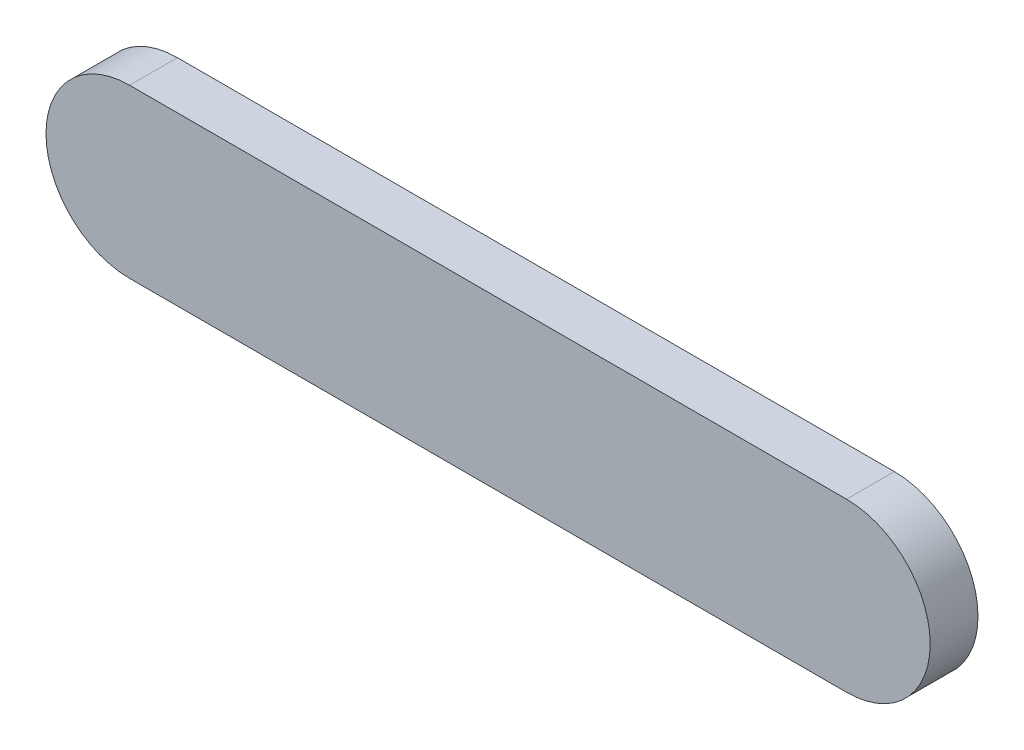
ISO-10303-21;
HEADER;
FILE_DESCRIPTION(('STEP AP214'),'2;1');
FILE_NAME('part.step','',(''),(''),'','','');
FILE_SCHEMA(('AUTOMOTIVE_DESIGN { 1 0 10303 214 1 1 1 1 }'));
ENDSEC;
DATA;
#1=APPLICATION_CONTEXT('core data for automotive mechanical design processes');
#2=APPLICATION_PROTOCOL_DEFINITION('international standard','automotive_design',2000,#1);
#3=PRODUCT_CONTEXT('',#1,'mechanical');
#4=PRODUCT('Part','Part','',(#3));
#5=PRODUCT_RELATED_PRODUCT_CATEGORY('part','',(#4));
#6=PRODUCT_DEFINITION_FORMATION('','',#4);
#7=PRODUCT_DEFINITION_CONTEXT('part definition',#1,'design');
#8=PRODUCT_DEFINITION('design','',#6,#7);
#9=PRODUCT_DEFINITION_SHAPE('','',#8);
#10=(LENGTH_UNIT() NAMED_UNIT(*) SI_UNIT(.MILLI.,.METRE.));
#11=(NAMED_UNIT(*) PLANE_ANGLE_UNIT() SI_UNIT($,.RADIAN.));
#12=(NAMED_UNIT(*) SI_UNIT($,.STERADIAN.) SOLID_ANGLE_UNIT());
#13=UNCERTAINTY_MEASURE_WITH_UNIT(LENGTH_MEASURE(1.E-05),#10,'distance_accuracy_value','');
#14=(GEOMETRIC_REPRESENTATION_CONTEXT(3) GLOBAL_UNCERTAINTY_ASSIGNED_CONTEXT((#13)) GLOBAL_UNIT_ASSIGNED_CONTEXT((#10,
#11,#12)) REPRESENTATION_CONTEXT('',''));
#15=CARTESIAN_POINT('',(0.,0.,0.));
#16=DIRECTION('',(0.,0.,1.));
#17=DIRECTION('',(1.,0.,0.));
#18=AXIS2_PLACEMENT_3D('',#15,#16,#17);
#19=CARTESIAN_POINT('',(-90.,0.,12.));
#20=DIRECTION('',(0.,0.,-1.));
#21=DIRECTION('',(-1.,0.,0.));
#22=AXIS2_PLACEMENT_3D('',#19,#20,#21);
#23=CYLINDRICAL_SURFACE('',#22,21.);
#24=CARTESIAN_POINT('',(-90.,0.,0.));
#25=DIRECTION('',(0.,0.,1.));
#26=DIRECTION('',(1.,0.,0.));
#27=AXIS2_PLACEMENT_3D('',#24,#25,#26);
#28=CIRCLE('',#27,21.);
#29=CARTESIAN_POINT('',(-90.,21.,0.));
#30=VERTEX_POINT('',#29);
#31=CARTESIAN_POINT('',(-90.,-21.,0.));
#32=VERTEX_POINT('',#31);
#33=EDGE_CURVE('E96',#30,#32,#28,.T.);
#34=ORIENTED_EDGE('',*,*,#33,.T.);
#35=DIRECTION('',(0.,0.,-1.));
#36=VECTOR('',#35,1.);
#37=CARTESIAN_POINT('',(-90.,-21.,12.));
#38=LINE('',#37,#36);
#39=CARTESIAN_POINT('',(-90.,-21.,12.));
#40=VERTEX_POINT('',#39);
#41=EDGE_CURVE('E11',#40,#32,#38,.T.);
#42=ORIENTED_EDGE('',*,*,#41,.F.);
#43=CARTESIAN_POINT('',(-90.,0.,12.));
#44=DIRECTION('',(0.,0.,1.));
#45=DIRECTION('',(1.,0.,0.));
#46=AXIS2_PLACEMENT_3D('',#43,#44,#45);
#47=CIRCLE('',#46,21.);
#48=CARTESIAN_POINT('',(-90.,21.,12.));
#49=VERTEX_POINT('',#48);
#50=EDGE_CURVE('E84',#49,#40,#47,.T.);
#51=ORIENTED_EDGE('',*,*,#50,.F.);
#52=DIRECTION('',(0.,0.,-1.));
#53=VECTOR('',#52,1.);
#54=CARTESIAN_POINT('',(-90.,21.,12.));
#55=LINE('',#54,#53);
#56=EDGE_CURVE('E92',#49,#30,#55,.T.);
#57=ORIENTED_EDGE('',*,*,#56,.T.);
#58=EDGE_LOOP('',(#34,#42,#51,#57));
#59=FACE_BOUND('',#58,.T.);
#60=ADVANCED_FACE('F33',(#59),#23,.T.);
#61=CARTESIAN_POINT('',(-90.,-21.,12.));
#62=DIRECTION('',(0.,1.,0.));
#63=DIRECTION('',(0.,0.,1.));
#64=AXIS2_PLACEMENT_3D('',#61,#62,#63);
#65=PLANE('',#64);
#66=DIRECTION('',(1.,0.,0.));
#67=VECTOR('',#66,1.);
#68=CARTESIAN_POINT('',(-90.,-21.,0.));
#69=LINE('',#68,#67);
#70=CARTESIAN_POINT('',(90.,-21.,0.));
#71=VERTEX_POINT('',#70);
#72=EDGE_CURVE('E88',#32,#71,#69,.T.);
#73=ORIENTED_EDGE('',*,*,#72,.T.);
#74=DIRECTION('',(0.,0.,-1.));
#75=VECTOR('',#74,1.);
#76=CARTESIAN_POINT('',(90.,-21.,12.));
#77=LINE('',#76,#75);
#78=CARTESIAN_POINT('',(90.,-21.,12.));
#79=VERTEX_POINT('',#78);
#80=EDGE_CURVE('E41',#79,#71,#77,.T.);
#81=ORIENTED_EDGE('',*,*,#80,.F.);
#82=DIRECTION('',(1.,0.,0.));
#83=VECTOR('',#82,1.);
#84=CARTESIAN_POINT('',(-90.,-21.,12.));
#85=LINE('',#84,#83);
#86=EDGE_CURVE('E79',#40,#79,#85,.T.);
#87=ORIENTED_EDGE('',*,*,#86,.F.);
#88=ORIENTED_EDGE('',*,*,#41,.T.);
#89=EDGE_LOOP('',(#73,#81,#87,#88));
#90=FACE_BOUND('',#89,.T.);
#91=ADVANCED_FACE('F87',(#90),#65,.F.);
#92=CARTESIAN_POINT('',(90.,0.,12.));
#93=DIRECTION('',(0.,0.,-1.));
#94=DIRECTION('',(-1.,0.,0.));
#95=AXIS2_PLACEMENT_3D('',#92,#93,#94);
#96=CYLINDRICAL_SURFACE('',#95,21.);
#97=CARTESIAN_POINT('',(90.,0.,0.));
#98=DIRECTION('',(0.,0.,1.));
#99=DIRECTION('',(1.,0.,0.));
#100=AXIS2_PLACEMENT_3D('',#97,#98,#99);
#101=CIRCLE('',#100,21.);
#102=CARTESIAN_POINT('',(90.,21.,0.));
#103=VERTEX_POINT('',#102);
#104=EDGE_CURVE('E66',#71,#103,#101,.T.);
#105=ORIENTED_EDGE('',*,*,#104,.T.);
#106=DIRECTION('',(0.,0.,-1.));
#107=VECTOR('',#106,1.);
#108=CARTESIAN_POINT('',(90.,21.,12.));
#109=LINE('',#108,#107);
#110=CARTESIAN_POINT('',(90.,21.,12.));
#111=VERTEX_POINT('',#110);
#112=EDGE_CURVE('E89',#111,#103,#109,.T.);
#113=ORIENTED_EDGE('',*,*,#112,.F.);
#114=CARTESIAN_POINT('',(90.,0.,12.));
#115=DIRECTION('',(0.,0.,1.));
#116=DIRECTION('',(1.,0.,0.));
#117=AXIS2_PLACEMENT_3D('',#114,#115,#116);
#118=CIRCLE('',#117,21.);
#119=EDGE_CURVE('E82',#79,#111,#118,.T.);
#120=ORIENTED_EDGE('',*,*,#119,.F.);
#121=ORIENTED_EDGE('',*,*,#80,.T.);
#122=EDGE_LOOP('',(#105,#113,#120,#121));
#123=FACE_BOUND('',#122,.T.);
#124=ADVANCED_FACE('F90',(#123),#96,.T.);
#125=CARTESIAN_POINT('',(-90.,21.,12.));
#126=DIRECTION('',(0.,-1.,0.));
#127=DIRECTION('',(0.,0.,-1.));
#128=AXIS2_PLACEMENT_3D('',#125,#126,#127);
#129=PLANE('',#128);
#130=DIRECTION('',(-1.,0.,0.));
#131=VECTOR('',#130,1.);
#132=CARTESIAN_POINT('',(-90.,21.,0.));
#133=LINE('',#132,#131);
#134=EDGE_CURVE('E72',#103,#30,#133,.T.);
#135=ORIENTED_EDGE('',*,*,#134,.T.);
#136=ORIENTED_EDGE('',*,*,#56,.F.);
#137=DIRECTION('',(-1.,0.,0.));
#138=VECTOR('',#137,1.);
#139=CARTESIAN_POINT('',(-90.,21.,12.));
#140=LINE('',#139,#138);
#141=EDGE_CURVE('E49',#111,#49,#140,.T.);
#142=ORIENTED_EDGE('',*,*,#141,.F.);
#143=ORIENTED_EDGE('',*,*,#112,.T.);
#144=EDGE_LOOP('',(#135,#136,#142,#143));
#145=FACE_BOUND('',#144,.T.);
#146=ADVANCED_FACE('F103',(#145),#129,.F.);
#147=CARTESIAN_POINT('',(-90.,0.,12.));
#148=DIRECTION('',(0.,0.,1.));
#149=DIRECTION('',(1.,0.,0.));
#150=AXIS2_PLACEMENT_3D('',#147,#148,#149);
#151=PLANE('',#150);
#152=ORIENTED_EDGE('',*,*,#50,.T.);
#153=ORIENTED_EDGE('',*,*,#86,.T.);
#154=ORIENTED_EDGE('',*,*,#119,.T.);
#155=ORIENTED_EDGE('',*,*,#141,.T.);
#156=EDGE_LOOP('',(#152,#153,#154,#155));
#157=FACE_BOUND('',#156,.T.);
#158=ADVANCED_FACE('F80',(#157),#151,.T.);
#159=CARTESIAN_POINT('',(-90.,0.,0.));
#160=DIRECTION('',(0.,0.,1.));
#161=DIRECTION('',(1.,0.,0.));
#162=AXIS2_PLACEMENT_3D('',#159,#160,#161);
#163=PLANE('',#162);
#164=ORIENTED_EDGE('',*,*,#33,.F.);
#165=ORIENTED_EDGE('',*,*,#134,.F.);
#166=ORIENTED_EDGE('',*,*,#104,.F.);
#167=ORIENTED_EDGE('',*,*,#72,.F.);
#168=EDGE_LOOP('',(#164,#165,#166,#167));
#169=FACE_BOUND('',#168,.T.);
#170=ADVANCED_FACE('F106',(#169),#163,.F.);
#171=CLOSED_SHELL('',(#60,#91,#124,#146,#158,#170));
#172=MANIFOLD_SOLID_BREP('B2',#171);
#173=ADVANCED_BREP_SHAPE_REPRESENTATION('',(#18,#172),#14);
#174=SHAPE_DEFINITION_REPRESENTATION(#9,#173);
ENDSEC;
END-ISO-10303-21;
